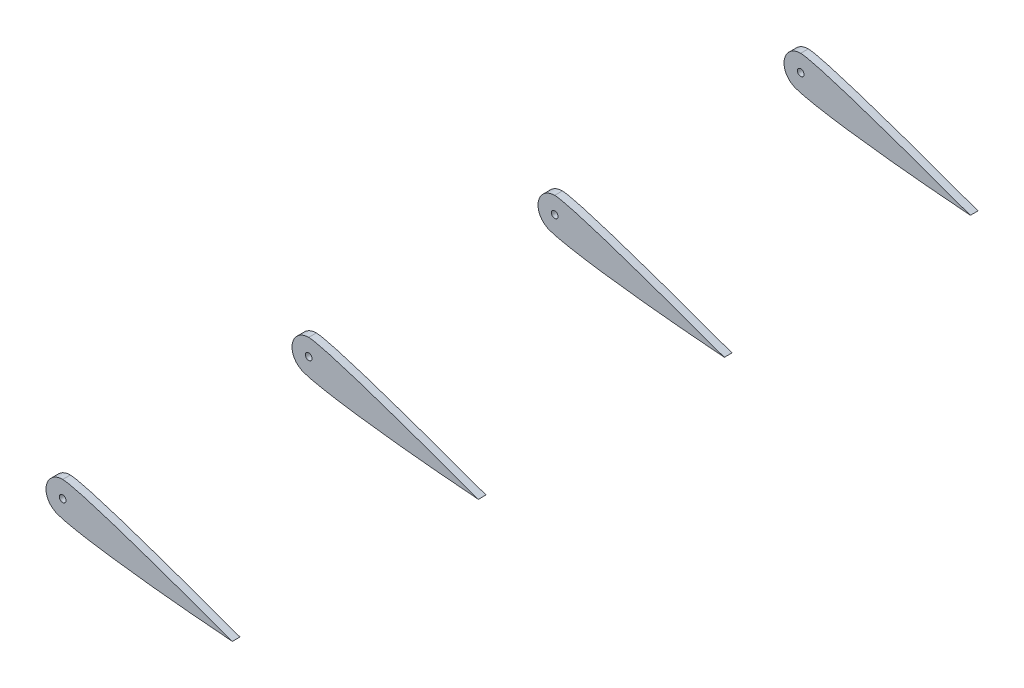
ISO-10303-21;
HEADER;
FILE_DESCRIPTION(('STEP AP214'),'2;1');
FILE_NAME('part.step','',(''),(''),'','','');
FILE_SCHEMA(('AUTOMOTIVE_DESIGN { 1 0 10303 214 1 1 1 1 }'));
ENDSEC;
DATA;
#1=APPLICATION_CONTEXT('core data for automotive mechanical design processes');
#2=APPLICATION_PROTOCOL_DEFINITION('international standard','automotive_design',2000,#1);
#3=PRODUCT_CONTEXT('',#1,'mechanical');
#4=PRODUCT('Part','Part','',(#3));
#5=PRODUCT_RELATED_PRODUCT_CATEGORY('part','',(#4));
#6=PRODUCT_DEFINITION_FORMATION('','',#4);
#7=PRODUCT_DEFINITION_CONTEXT('part definition',#1,'design');
#8=PRODUCT_DEFINITION('design','',#6,#7);
#9=PRODUCT_DEFINITION_SHAPE('','',#8);
#10=(LENGTH_UNIT() NAMED_UNIT(*) SI_UNIT(.MILLI.,.METRE.));
#11=(NAMED_UNIT(*) PLANE_ANGLE_UNIT() SI_UNIT($,.RADIAN.));
#12=(NAMED_UNIT(*) SI_UNIT($,.STERADIAN.) SOLID_ANGLE_UNIT());
#13=UNCERTAINTY_MEASURE_WITH_UNIT(LENGTH_MEASURE(1.E-05),#10,'distance_accuracy_value','');
#14=(GEOMETRIC_REPRESENTATION_CONTEXT(3) GLOBAL_UNCERTAINTY_ASSIGNED_CONTEXT((#13)) GLOBAL_UNIT_ASSIGNED_CONTEXT((#10,
#11,#12)) REPRESENTATION_CONTEXT('',''));
#15=CARTESIAN_POINT('',(0.,0.,0.));
#16=DIRECTION('',(0.,0.,1.));
#17=DIRECTION('',(1.,0.,0.));
#18=AXIS2_PLACEMENT_3D('',#15,#16,#17);
#19=CARTESIAN_POINT('',(15.6162319578332,0.772511857000253,223.266));
#20=DIRECTION('',(0.,0.,1.));
#21=DIRECTION('',(1.,0.,0.));
#22=AXIS2_PLACEMENT_3D('',#19,#20,#21);
#23=PLANE('',#22);
#24=CARTESIAN_POINT('',(50.8000000000001,-11.6107413862354,223.266));
#25=CARTESIAN_POINT('',(5.83246391566635,4.85039440711823,223.266));
#26=CARTESIAN_POINT('',(0.,5.,223.266));
#27=B_SPLINE_CURVE_WITH_KNOTS('',2,(#24,#25,#26),.UNSPECIFIED.,.F.,.F.,(3,3),(0.,1.),.UNSPECIFIED.);
#28=CARTESIAN_POINT('',(50.8000000000001,-11.6107413862354,223.266));
#29=VERTEX_POINT('',#28);
#30=CARTESIAN_POINT('',(0.,5.,223.266));
#31=VERTEX_POINT('',#30);
#32=EDGE_CURVE('E86',#29,#31,#27,.T.);
#33=ORIENTED_EDGE('',*,*,#32,.T.);
#34=CARTESIAN_POINT('',(0.,0.,223.266));
#35=DIRECTION('',(0.,0.,1.));
#36=DIRECTION('',(1.,0.,0.));
#37=AXIS2_PLACEMENT_3D('',#34,#35,#36);
#38=CIRCLE('',#37,5.);
#39=CARTESIAN_POINT('',(-2.42540850180828,-4.37234417668098,223.266));
#40=VERTEX_POINT('',#39);
#41=EDGE_CURVE('E82',#31,#40,#38,.T.);
#42=ORIENTED_EDGE('',*,*,#41,.T.);
#43=CARTESIAN_POINT('',(-2.42540850180828,-4.37234417668098,223.266));
#44=CARTESIAN_POINT('',(-0.753845449582207,-5.81112807303867,223.266));
#45=CARTESIAN_POINT('',(16.9221191637549,-8.96235950169323,223.266));
#46=CARTESIAN_POINT('',(50.8000000000001,-11.6107413862354,223.266));
#47=B_SPLINE_CURVE_WITH_KNOTS('',3,(#43,#44,#45,#46),.UNSPECIFIED.,.F.,.F.,(4,4),(0.,1.),.UNSPECIFIED.);
#48=EDGE_CURVE('E62',#40,#29,#47,.T.);
#49=ORIENTED_EDGE('',*,*,#48,.T.);
#50=EDGE_LOOP('',(#33,#42,#49));
#51=FACE_BOUND('',#50,.T.);
#52=CARTESIAN_POINT('',(0.,0.,223.266));
#53=DIRECTION('',(0.,0.,1.));
#54=DIRECTION('',(1.,0.,0.));
#55=AXIS2_PLACEMENT_3D('',#52,#53,#54);
#56=CIRCLE('',#55,0.999999999999998);
#57=CARTESIAN_POINT('',(0.999999999999998,0.,223.266));
#58=VERTEX_POINT('',#57);
#59=EDGE_CURVE('E95',#58,#58,#56,.T.);
#60=ORIENTED_EDGE('',*,*,#59,.F.);
#61=EDGE_LOOP('',(#60));
#62=FACE_BOUND('',#61,.T.);
#63=ADVANCED_FACE('F44',(#51,#62),#23,.T.);
#64=CARTESIAN_POINT('',(15.6162319578332,0.772511857000253,220.98));
#65=DIRECTION('',(0.,0.,1.));
#66=DIRECTION('',(1.,0.,0.));
#67=AXIS2_PLACEMENT_3D('',#64,#65,#66);
#68=PLANE('',#67);
#69=CARTESIAN_POINT('',(50.8000000000001,-11.6107413862354,220.98));
#70=CARTESIAN_POINT('',(5.83246391566635,4.85039440711823,220.98));
#71=CARTESIAN_POINT('',(0.,5.,220.98));
#72=B_SPLINE_CURVE_WITH_KNOTS('',2,(#69,#70,#71),.UNSPECIFIED.,.F.,.F.,(3,3),(0.,1.),.UNSPECIFIED.);
#73=CARTESIAN_POINT('',(50.8000000000001,-11.6107413862354,220.98));
#74=VERTEX_POINT('',#73);
#75=CARTESIAN_POINT('',(0.,5.,220.98));
#76=VERTEX_POINT('',#75);
#77=EDGE_CURVE('E92',#74,#76,#72,.T.);
#78=ORIENTED_EDGE('',*,*,#77,.F.);
#79=CARTESIAN_POINT('',(-2.42540850180828,-4.37234417668098,220.98));
#80=CARTESIAN_POINT('',(-0.753845449582207,-5.81112807303867,220.98));
#81=CARTESIAN_POINT('',(16.9221191637549,-8.96235950169323,220.98));
#82=CARTESIAN_POINT('',(50.8000000000001,-11.6107413862354,220.98));
#83=B_SPLINE_CURVE_WITH_KNOTS('',3,(#79,#80,#81,#82),.UNSPECIFIED.,.F.,.F.,(4,4),(0.,1.),.UNSPECIFIED.);
#84=CARTESIAN_POINT('',(-2.42540850180828,-4.37234417668098,220.98));
#85=VERTEX_POINT('',#84);
#86=EDGE_CURVE('E79',#85,#74,#83,.T.);
#87=ORIENTED_EDGE('',*,*,#86,.F.);
#88=CARTESIAN_POINT('',(0.,0.,220.98));
#89=DIRECTION('',(0.,0.,1.));
#90=DIRECTION('',(1.,0.,0.));
#91=AXIS2_PLACEMENT_3D('',#88,#89,#90);
#92=CIRCLE('',#91,5.);
#93=EDGE_CURVE('E74',#76,#85,#92,.T.);
#94=ORIENTED_EDGE('',*,*,#93,.F.);
#95=EDGE_LOOP('',(#78,#87,#94));
#96=FACE_BOUND('',#95,.T.);
#97=CARTESIAN_POINT('',(0.,0.,220.98));
#98=DIRECTION('',(0.,0.,1.));
#99=DIRECTION('',(1.,0.,0.));
#100=AXIS2_PLACEMENT_3D('',#97,#98,#99);
#101=CIRCLE('',#100,0.999999999999998);
#102=CARTESIAN_POINT('',(0.999999999999998,0.,220.98));
#103=VERTEX_POINT('',#102);
#104=EDGE_CURVE('E99',#103,#103,#101,.T.);
#105=ORIENTED_EDGE('',*,*,#104,.T.);
#106=EDGE_LOOP('',(#105));
#107=FACE_BOUND('',#106,.T.);
#108=ADVANCED_FACE('F118',(#96,#107),#68,.F.);
#109=DIRECTION('',(0.,0.,-1.));
#110=VECTOR('',#109,1.);
#111=SURFACE_OF_LINEAR_EXTRUSION('',#27,#110);
#112=ORIENTED_EDGE('',*,*,#77,.T.);
#113=DIRECTION('',(0.,0.,-1.));
#114=VECTOR('',#113,1.);
#115=CARTESIAN_POINT('',(0.,5.,223.266));
#116=LINE('',#115,#114);
#117=EDGE_CURVE('E12',#31,#76,#116,.T.);
#118=ORIENTED_EDGE('',*,*,#117,.F.);
#119=ORIENTED_EDGE('',*,*,#32,.F.);
#120=DIRECTION('',(0.,0.,-1.));
#121=VECTOR('',#120,1.);
#122=CARTESIAN_POINT('',(50.8000000000001,-11.6107413862354,223.266));
#123=LINE('',#122,#121);
#124=EDGE_CURVE('E93',#29,#74,#123,.T.);
#125=ORIENTED_EDGE('',*,*,#124,.T.);
#126=EDGE_LOOP('',(#112,#118,#119,#125));
#127=FACE_BOUND('',#126,.T.);
#128=ADVANCED_FACE('F46',(#127),#111,.F.);
#129=CARTESIAN_POINT('',(0.,0.,223.266));
#130=DIRECTION('',(0.,0.,-1.));
#131=DIRECTION('',(-1.,0.,0.));
#132=AXIS2_PLACEMENT_3D('',#129,#130,#131);
#133=CYLINDRICAL_SURFACE('',#132,5.);
#134=ORIENTED_EDGE('',*,*,#93,.T.);
#135=DIRECTION('',(0.,0.,-1.));
#136=VECTOR('',#135,1.);
#137=CARTESIAN_POINT('',(-2.42540850180828,-4.37234417668098,223.266));
#138=LINE('',#137,#136);
#139=EDGE_CURVE('E54',#40,#85,#138,.T.);
#140=ORIENTED_EDGE('',*,*,#139,.F.);
#141=ORIENTED_EDGE('',*,*,#41,.F.);
#142=ORIENTED_EDGE('',*,*,#117,.T.);
#143=EDGE_LOOP('',(#134,#140,#141,#142));
#144=FACE_BOUND('',#143,.T.);
#145=ADVANCED_FACE('F83',(#144),#133,.T.);
#146=DIRECTION('',(0.,0.,-1.));
#147=VECTOR('',#146,1.);
#148=SURFACE_OF_LINEAR_EXTRUSION('',#47,#147);
#149=ORIENTED_EDGE('',*,*,#86,.T.);
#150=ORIENTED_EDGE('',*,*,#124,.F.);
#151=ORIENTED_EDGE('',*,*,#48,.F.);
#152=ORIENTED_EDGE('',*,*,#139,.T.);
#153=EDGE_LOOP('',(#149,#150,#151,#152));
#154=FACE_BOUND('',#153,.T.);
#155=ADVANCED_FACE('F117',(#154),#148,.F.);
#156=CARTESIAN_POINT('',(0.,0.,223.266));
#157=DIRECTION('',(0.,0.,-1.));
#158=DIRECTION('',(-1.,0.,0.));
#159=AXIS2_PLACEMENT_3D('',#156,#157,#158);
#160=CYLINDRICAL_SURFACE('',#159,0.999999999999998);
#161=ORIENTED_EDGE('',*,*,#59,.T.);
#162=EDGE_LOOP('',(#161));
#163=FACE_BOUND('',#162,.T.);
#164=ORIENTED_EDGE('',*,*,#104,.F.);
#165=EDGE_LOOP('',(#164));
#166=FACE_BOUND('',#165,.T.);
#167=ADVANCED_FACE('F132',(#163,#166),#160,.F.);
#168=CLOSED_SHELL('',(#63,#108,#128,#145,#155,#167));
#169=MANIFOLD_SOLID_BREP('B2',#168);
#170=CARTESIAN_POINT('',(15.6162319578332,0.772511857000253,149.606));
#171=DIRECTION('',(0.,0.,1.));
#172=DIRECTION('',(1.,0.,0.));
#173=AXIS2_PLACEMENT_3D('',#170,#171,#172);
#174=PLANE('',#173);
#175=CARTESIAN_POINT('',(50.8000000000001,-11.6107413862354,149.606));
#176=CARTESIAN_POINT('',(5.83246391566635,4.85039440711823,149.606));
#177=CARTESIAN_POINT('',(0.,5.,149.606));
#178=B_SPLINE_CURVE_WITH_KNOTS('',2,(#175,#176,#177),.UNSPECIFIED.,.F.,.F.,(3,3),(0.,1.),.UNSPECIFIED.);
#179=CARTESIAN_POINT('',(50.8000000000001,-11.6107413862354,149.606));
#180=VERTEX_POINT('',#179);
#181=CARTESIAN_POINT('',(0.,5.,149.606));
#182=VERTEX_POINT('',#181);
#183=EDGE_CURVE('E237',#180,#182,#178,.T.);
#184=ORIENTED_EDGE('',*,*,#183,.T.);
#185=CARTESIAN_POINT('',(0.,0.,149.606));
#186=DIRECTION('',(0.,0.,1.));
#187=DIRECTION('',(1.,0.,0.));
#188=AXIS2_PLACEMENT_3D('',#185,#186,#187);
#189=CIRCLE('',#188,5.);
#190=CARTESIAN_POINT('',(-2.42540850180828,-4.37234417668098,149.606));
#191=VERTEX_POINT('',#190);
#192=EDGE_CURVE('E233',#182,#191,#189,.T.);
#193=ORIENTED_EDGE('',*,*,#192,.T.);
#194=CARTESIAN_POINT('',(-2.42540850180828,-4.37234417668098,149.606));
#195=CARTESIAN_POINT('',(-0.753845449582207,-5.81112807303867,149.606));
#196=CARTESIAN_POINT('',(16.9221191637549,-8.96235950169323,149.606));
#197=CARTESIAN_POINT('',(50.8000000000001,-11.6107413862354,149.606));
#198=B_SPLINE_CURVE_WITH_KNOTS('',3,(#194,#195,#196,#197),.UNSPECIFIED.,.F.,.F.,(4,4),(0.,1.),.UNSPECIFIED.);
#199=EDGE_CURVE('E213',#191,#180,#198,.T.);
#200=ORIENTED_EDGE('',*,*,#199,.T.);
#201=EDGE_LOOP('',(#184,#193,#200));
#202=FACE_BOUND('',#201,.T.);
#203=CARTESIAN_POINT('',(0.,0.,149.606));
#204=DIRECTION('',(0.,0.,1.));
#205=DIRECTION('',(1.,0.,0.));
#206=AXIS2_PLACEMENT_3D('',#203,#204,#205);
#207=CIRCLE('',#206,0.999999999999998);
#208=CARTESIAN_POINT('',(0.999999999999998,0.,149.606));
#209=VERTEX_POINT('',#208);
#210=EDGE_CURVE('E246',#209,#209,#207,.T.);
#211=ORIENTED_EDGE('',*,*,#210,.F.);
#212=EDGE_LOOP('',(#211));
#213=FACE_BOUND('',#212,.T.);
#214=ADVANCED_FACE('F195',(#202,#213),#174,.T.);
#215=CARTESIAN_POINT('',(15.6162319578332,0.772511857000253,147.32));
#216=DIRECTION('',(0.,0.,1.));
#217=DIRECTION('',(1.,0.,0.));
#218=AXIS2_PLACEMENT_3D('',#215,#216,#217);
#219=PLANE('',#218);
#220=CARTESIAN_POINT('',(50.8000000000001,-11.6107413862354,147.32));
#221=CARTESIAN_POINT('',(5.83246391566635,4.85039440711823,147.32));
#222=CARTESIAN_POINT('',(0.,5.,147.32));
#223=B_SPLINE_CURVE_WITH_KNOTS('',2,(#220,#221,#222),.UNSPECIFIED.,.F.,.F.,(3,3),(0.,1.),.UNSPECIFIED.);
#224=CARTESIAN_POINT('',(50.8000000000001,-11.6107413862354,147.32));
#225=VERTEX_POINT('',#224);
#226=CARTESIAN_POINT('',(0.,5.,147.32));
#227=VERTEX_POINT('',#226);
#228=EDGE_CURVE('E243',#225,#227,#223,.T.);
#229=ORIENTED_EDGE('',*,*,#228,.F.);
#230=CARTESIAN_POINT('',(-2.42540850180828,-4.37234417668098,147.32));
#231=CARTESIAN_POINT('',(-0.753845449582207,-5.81112807303867,147.32));
#232=CARTESIAN_POINT('',(16.9221191637549,-8.96235950169323,147.32));
#233=CARTESIAN_POINT('',(50.8000000000001,-11.6107413862354,147.32));
#234=B_SPLINE_CURVE_WITH_KNOTS('',3,(#230,#231,#232,#233),.UNSPECIFIED.,.F.,.F.,(4,4),(0.,1.),.UNSPECIFIED.);
#235=CARTESIAN_POINT('',(-2.42540850180828,-4.37234417668098,147.32));
#236=VERTEX_POINT('',#235);
#237=EDGE_CURVE('E230',#236,#225,#234,.T.);
#238=ORIENTED_EDGE('',*,*,#237,.F.);
#239=CARTESIAN_POINT('',(0.,0.,147.32));
#240=DIRECTION('',(0.,0.,1.));
#241=DIRECTION('',(1.,0.,0.));
#242=AXIS2_PLACEMENT_3D('',#239,#240,#241);
#243=CIRCLE('',#242,5.);
#244=EDGE_CURVE('E225',#227,#236,#243,.T.);
#245=ORIENTED_EDGE('',*,*,#244,.F.);
#246=EDGE_LOOP('',(#229,#238,#245));
#247=FACE_BOUND('',#246,.T.);
#248=CARTESIAN_POINT('',(0.,0.,147.32));
#249=DIRECTION('',(0.,0.,1.));
#250=DIRECTION('',(1.,0.,0.));
#251=AXIS2_PLACEMENT_3D('',#248,#249,#250);
#252=CIRCLE('',#251,0.999999999999998);
#253=CARTESIAN_POINT('',(0.999999999999998,0.,147.32));
#254=VERTEX_POINT('',#253);
#255=EDGE_CURVE('E250',#254,#254,#252,.T.);
#256=ORIENTED_EDGE('',*,*,#255,.T.);
#257=EDGE_LOOP('',(#256));
#258=FACE_BOUND('',#257,.T.);
#259=ADVANCED_FACE('F269',(#247,#258),#219,.F.);
#260=DIRECTION('',(0.,0.,-1.));
#261=VECTOR('',#260,1.);
#262=SURFACE_OF_LINEAR_EXTRUSION('',#178,#261);
#263=ORIENTED_EDGE('',*,*,#228,.T.);
#264=DIRECTION('',(0.,0.,-1.));
#265=VECTOR('',#264,1.);
#266=CARTESIAN_POINT('',(0.,5.,149.606));
#267=LINE('',#266,#265);
#268=EDGE_CURVE('E42',#182,#227,#267,.T.);
#269=ORIENTED_EDGE('',*,*,#268,.F.);
#270=ORIENTED_EDGE('',*,*,#183,.F.);
#271=DIRECTION('',(0.,0.,-1.));
#272=VECTOR('',#271,1.);
#273=CARTESIAN_POINT('',(50.8000000000001,-11.6107413862354,149.606));
#274=LINE('',#273,#272);
#275=EDGE_CURVE('E244',#180,#225,#274,.T.);
#276=ORIENTED_EDGE('',*,*,#275,.T.);
#277=EDGE_LOOP('',(#263,#269,#270,#276));
#278=FACE_BOUND('',#277,.T.);
#279=ADVANCED_FACE('F197',(#278),#262,.F.);
#280=CARTESIAN_POINT('',(0.,0.,149.606));
#281=DIRECTION('',(0.,0.,-1.));
#282=DIRECTION('',(-1.,0.,0.));
#283=AXIS2_PLACEMENT_3D('',#280,#281,#282);
#284=CYLINDRICAL_SURFACE('',#283,5.);
#285=ORIENTED_EDGE('',*,*,#244,.T.);
#286=DIRECTION('',(0.,0.,-1.));
#287=VECTOR('',#286,1.);
#288=CARTESIAN_POINT('',(-2.42540850180828,-4.37234417668098,149.606));
#289=LINE('',#288,#287);
#290=EDGE_CURVE('E205',#191,#236,#289,.T.);
#291=ORIENTED_EDGE('',*,*,#290,.F.);
#292=ORIENTED_EDGE('',*,*,#192,.F.);
#293=ORIENTED_EDGE('',*,*,#268,.T.);
#294=EDGE_LOOP('',(#285,#291,#292,#293));
#295=FACE_BOUND('',#294,.T.);
#296=ADVANCED_FACE('F234',(#295),#284,.T.);
#297=DIRECTION('',(0.,0.,-1.));
#298=VECTOR('',#297,1.);
#299=SURFACE_OF_LINEAR_EXTRUSION('',#198,#298);
#300=ORIENTED_EDGE('',*,*,#237,.T.);
#301=ORIENTED_EDGE('',*,*,#275,.F.);
#302=ORIENTED_EDGE('',*,*,#199,.F.);
#303=ORIENTED_EDGE('',*,*,#290,.T.);
#304=EDGE_LOOP('',(#300,#301,#302,#303));
#305=FACE_BOUND('',#304,.T.);
#306=ADVANCED_FACE('F268',(#305),#299,.F.);
#307=CARTESIAN_POINT('',(0.,0.,149.606));
#308=DIRECTION('',(0.,0.,-1.));
#309=DIRECTION('',(-1.,0.,0.));
#310=AXIS2_PLACEMENT_3D('',#307,#308,#309);
#311=CYLINDRICAL_SURFACE('',#310,0.999999999999998);
#312=ORIENTED_EDGE('',*,*,#210,.T.);
#313=EDGE_LOOP('',(#312));
#314=FACE_BOUND('',#313,.T.);
#315=ORIENTED_EDGE('',*,*,#255,.F.);
#316=EDGE_LOOP('',(#315));
#317=FACE_BOUND('',#316,.T.);
#318=ADVANCED_FACE('F283',(#314,#317),#311,.F.);
#319=CLOSED_SHELL('',(#214,#259,#279,#296,#306,#318));
#320=MANIFOLD_SOLID_BREP('B6',#319);
#321=CARTESIAN_POINT('',(15.6162319578332,0.772511857000253,75.946));
#322=DIRECTION('',(0.,0.,1.));
#323=DIRECTION('',(1.,0.,0.));
#324=AXIS2_PLACEMENT_3D('',#321,#322,#323);
#325=PLANE('',#324);
#326=CARTESIAN_POINT('',(50.8000000000001,-11.6107413862354,75.946));
#327=CARTESIAN_POINT('',(5.83246391566635,4.85039440711823,75.946));
#328=CARTESIAN_POINT('',(0.,5.,75.946));
#329=B_SPLINE_CURVE_WITH_KNOTS('',2,(#326,#327,#328),.UNSPECIFIED.,.F.,.F.,(3,3),(0.,1.),.UNSPECIFIED.);
#330=CARTESIAN_POINT('',(50.8000000000001,-11.6107413862354,75.946));
#331=VERTEX_POINT('',#330);
#332=CARTESIAN_POINT('',(0.,5.,75.946));
#333=VERTEX_POINT('',#332);
#334=EDGE_CURVE('E387',#331,#333,#329,.T.);
#335=ORIENTED_EDGE('',*,*,#334,.T.);
#336=CARTESIAN_POINT('',(0.,0.,75.946));
#337=DIRECTION('',(0.,0.,1.));
#338=DIRECTION('',(1.,0.,0.));
#339=AXIS2_PLACEMENT_3D('',#336,#337,#338);
#340=CIRCLE('',#339,5.);
#341=CARTESIAN_POINT('',(-2.42540850180828,-4.37234417668098,75.946));
#342=VERTEX_POINT('',#341);
#343=EDGE_CURVE('E383',#333,#342,#340,.T.);
#344=ORIENTED_EDGE('',*,*,#343,.T.);
#345=CARTESIAN_POINT('',(-2.42540850180828,-4.37234417668098,75.946));
#346=CARTESIAN_POINT('',(-0.753845449582207,-5.81112807303867,75.946));
#347=CARTESIAN_POINT('',(16.9221191637549,-8.96235950169323,75.946));
#348=CARTESIAN_POINT('',(50.8000000000001,-11.6107413862354,75.946));
#349=B_SPLINE_CURVE_WITH_KNOTS('',3,(#345,#346,#347,#348),.UNSPECIFIED.,.F.,.F.,(4,4),(0.,1.),.UNSPECIFIED.);
#350=EDGE_CURVE('E363',#342,#331,#349,.T.);
#351=ORIENTED_EDGE('',*,*,#350,.T.);
#352=EDGE_LOOP('',(#335,#344,#351));
#353=FACE_BOUND('',#352,.T.);
#354=CARTESIAN_POINT('',(0.,0.,75.946));
#355=DIRECTION('',(0.,0.,1.));
#356=DIRECTION('',(1.,0.,0.));
#357=AXIS2_PLACEMENT_3D('',#354,#355,#356);
#358=CIRCLE('',#357,0.999999999999998);
#359=CARTESIAN_POINT('',(0.999999999999998,0.,75.946));
#360=VERTEX_POINT('',#359);
#361=EDGE_CURVE('E396',#360,#360,#358,.T.);
#362=ORIENTED_EDGE('',*,*,#361,.F.);
#363=EDGE_LOOP('',(#362));
#364=FACE_BOUND('',#363,.T.);
#365=ADVANCED_FACE('F345',(#353,#364),#325,.T.);
#366=CARTESIAN_POINT('',(15.6162319578332,0.772511857000253,73.66));
#367=DIRECTION('',(0.,0.,1.));
#368=DIRECTION('',(1.,0.,0.));
#369=AXIS2_PLACEMENT_3D('',#366,#367,#368);
#370=PLANE('',#369);
#371=CARTESIAN_POINT('',(50.8000000000001,-11.6107413862354,73.66));
#372=CARTESIAN_POINT('',(5.83246391566635,4.85039440711823,73.66));
#373=CARTESIAN_POINT('',(0.,5.,73.66));
#374=B_SPLINE_CURVE_WITH_KNOTS('',2,(#371,#372,#373),.UNSPECIFIED.,.F.,.F.,(3,3),(0.,1.),.UNSPECIFIED.);
#375=CARTESIAN_POINT('',(50.8000000000001,-11.6107413862354,73.66));
#376=VERTEX_POINT('',#375);
#377=CARTESIAN_POINT('',(0.,5.,73.66));
#378=VERTEX_POINT('',#377);
#379=EDGE_CURVE('E393',#376,#378,#374,.T.);
#380=ORIENTED_EDGE('',*,*,#379,.F.);
#381=CARTESIAN_POINT('',(-2.42540850180828,-4.37234417668098,73.66));
#382=CARTESIAN_POINT('',(-0.753845449582207,-5.81112807303867,73.66));
#383=CARTESIAN_POINT('',(16.9221191637549,-8.96235950169323,73.66));
#384=CARTESIAN_POINT('',(50.8000000000001,-11.6107413862354,73.66));
#385=B_SPLINE_CURVE_WITH_KNOTS('',3,(#381,#382,#383,#384),.UNSPECIFIED.,.F.,.F.,(4,4),(0.,1.),.UNSPECIFIED.);
#386=CARTESIAN_POINT('',(-2.42540850180828,-4.37234417668098,73.66));
#387=VERTEX_POINT('',#386);
#388=EDGE_CURVE('E380',#387,#376,#385,.T.);
#389=ORIENTED_EDGE('',*,*,#388,.F.);
#390=CARTESIAN_POINT('',(0.,0.,73.66));
#391=DIRECTION('',(0.,0.,1.));
#392=DIRECTION('',(1.,0.,0.));
#393=AXIS2_PLACEMENT_3D('',#390,#391,#392);
#394=CIRCLE('',#393,5.);
#395=EDGE_CURVE('E375',#378,#387,#394,.T.);
#396=ORIENTED_EDGE('',*,*,#395,.F.);
#397=EDGE_LOOP('',(#380,#389,#396));
#398=FACE_BOUND('',#397,.T.);
#399=CARTESIAN_POINT('',(0.,0.,73.66));
#400=DIRECTION('',(0.,0.,1.));
#401=DIRECTION('',(1.,0.,0.));
#402=AXIS2_PLACEMENT_3D('',#399,#400,#401);
#403=CIRCLE('',#402,0.999999999999998);
#404=CARTESIAN_POINT('',(0.999999999999998,0.,73.66));
#405=VERTEX_POINT('',#404);
#406=EDGE_CURVE('E400',#405,#405,#403,.T.);
#407=ORIENTED_EDGE('',*,*,#406,.T.);
#408=EDGE_LOOP('',(#407));
#409=FACE_BOUND('',#408,.T.);
#410=ADVANCED_FACE('F419',(#398,#409),#370,.F.);
#411=DIRECTION('',(0.,0.,-1.));
#412=VECTOR('',#411,1.);
#413=SURFACE_OF_LINEAR_EXTRUSION('',#329,#412);
#414=ORIENTED_EDGE('',*,*,#379,.T.);
#415=DIRECTION('',(0.,0.,-1.));
#416=VECTOR('',#415,1.);
#417=CARTESIAN_POINT('',(0.,5.,75.946));
#418=LINE('',#417,#416);
#419=EDGE_CURVE('E193',#333,#378,#418,.T.);
#420=ORIENTED_EDGE('',*,*,#419,.F.);
#421=ORIENTED_EDGE('',*,*,#334,.F.);
#422=DIRECTION('',(0.,0.,-1.));
#423=VECTOR('',#422,1.);
#424=CARTESIAN_POINT('',(50.8000000000001,-11.6107413862354,75.946));
#425=LINE('',#424,#423);
#426=EDGE_CURVE('E394',#331,#376,#425,.T.);
#427=ORIENTED_EDGE('',*,*,#426,.T.);
#428=EDGE_LOOP('',(#414,#420,#421,#427));
#429=FACE_BOUND('',#428,.T.);
#430=ADVANCED_FACE('F347',(#429),#413,.F.);
#431=CARTESIAN_POINT('',(0.,0.,75.946));
#432=DIRECTION('',(0.,0.,-1.));
#433=DIRECTION('',(-1.,0.,0.));
#434=AXIS2_PLACEMENT_3D('',#431,#432,#433);
#435=CYLINDRICAL_SURFACE('',#434,5.);
#436=ORIENTED_EDGE('',*,*,#395,.T.);
#437=DIRECTION('',(0.,0.,-1.));
#438=VECTOR('',#437,1.);
#439=CARTESIAN_POINT('',(-2.42540850180828,-4.37234417668098,75.946));
#440=LINE('',#439,#438);
#441=EDGE_CURVE('E355',#342,#387,#440,.T.);
#442=ORIENTED_EDGE('',*,*,#441,.F.);
#443=ORIENTED_EDGE('',*,*,#343,.F.);
#444=ORIENTED_EDGE('',*,*,#419,.T.);
#445=EDGE_LOOP('',(#436,#442,#443,#444));
#446=FACE_BOUND('',#445,.T.);
#447=ADVANCED_FACE('F384',(#446),#435,.T.);
#448=DIRECTION('',(0.,0.,-1.));
#449=VECTOR('',#448,1.);
#450=SURFACE_OF_LINEAR_EXTRUSION('',#349,#449);
#451=ORIENTED_EDGE('',*,*,#388,.T.);
#452=ORIENTED_EDGE('',*,*,#426,.F.);
#453=ORIENTED_EDGE('',*,*,#350,.F.);
#454=ORIENTED_EDGE('',*,*,#441,.T.);
#455=EDGE_LOOP('',(#451,#452,#453,#454));
#456=FACE_BOUND('',#455,.T.);
#457=ADVANCED_FACE('F418',(#456),#450,.F.);
#458=CARTESIAN_POINT('',(0.,0.,75.946));
#459=DIRECTION('',(0.,0.,-1.));
#460=DIRECTION('',(-1.,0.,0.));
#461=AXIS2_PLACEMENT_3D('',#458,#459,#460);
#462=CYLINDRICAL_SURFACE('',#461,0.999999999999998);
#463=ORIENTED_EDGE('',*,*,#361,.T.);
#464=EDGE_LOOP('',(#463));
#465=FACE_BOUND('',#464,.T.);
#466=ORIENTED_EDGE('',*,*,#406,.F.);
#467=EDGE_LOOP('',(#466));
#468=FACE_BOUND('',#467,.T.);
#469=ADVANCED_FACE('F433',(#465,#468),#462,.F.);
#470=CLOSED_SHELL('',(#365,#410,#430,#447,#457,#469));
#471=MANIFOLD_SOLID_BREP('B36',#470);
#472=CARTESIAN_POINT('',(15.6162319578332,0.772511857000253,2.286));
#473=DIRECTION('',(0.,0.,1.));
#474=DIRECTION('',(1.,0.,0.));
#475=AXIS2_PLACEMENT_3D('',#472,#473,#474);
#476=PLANE('',#475);
#477=CARTESIAN_POINT('',(50.8000000000001,-11.6107413862354,2.286));
#478=CARTESIAN_POINT('',(5.83246391566635,4.85039440711823,2.286));
#479=CARTESIAN_POINT('',(0.,5.,2.286));
#480=B_SPLINE_CURVE_WITH_KNOTS('',2,(#477,#478,#479),.UNSPECIFIED.,.F.,.F.,(3,3),(0.,1.),.UNSPECIFIED.);
#481=CARTESIAN_POINT('',(50.8000000000001,-11.6107413862354,2.286));
#482=VERTEX_POINT('',#481);
#483=CARTESIAN_POINT('',(0.,5.,2.286));
#484=VERTEX_POINT('',#483);
#485=EDGE_CURVE('E528',#482,#484,#480,.T.);
#486=ORIENTED_EDGE('',*,*,#485,.T.);
#487=CARTESIAN_POINT('',(0.,0.,2.286));
#488=DIRECTION('',(0.,0.,1.));
#489=DIRECTION('',(1.,0.,0.));
#490=AXIS2_PLACEMENT_3D('',#487,#488,#489);
#491=CIRCLE('',#490,5.);
#492=CARTESIAN_POINT('',(-2.42540850180828,-4.37234417668098,2.286));
#493=VERTEX_POINT('',#492);
#494=EDGE_CURVE('E524',#484,#493,#491,.T.);
#495=ORIENTED_EDGE('',*,*,#494,.T.);
#496=CARTESIAN_POINT('',(-2.42540850180828,-4.37234417668098,2.286));
#497=CARTESIAN_POINT('',(-0.753845449582207,-5.81112807303867,2.286));
#498=CARTESIAN_POINT('',(16.9221191637549,-8.96235950169323,2.286));
#499=CARTESIAN_POINT('',(50.8000000000001,-11.6107413862354,2.286));
#500=B_SPLINE_CURVE_WITH_KNOTS('',3,(#496,#497,#498,#499),.UNSPECIFIED.,.F.,.F.,(4,4),(0.,1.),.UNSPECIFIED.);
#501=EDGE_CURVE('E504',#493,#482,#500,.T.);
#502=ORIENTED_EDGE('',*,*,#501,.T.);
#503=EDGE_LOOP('',(#486,#495,#502));
#504=FACE_BOUND('',#503,.T.);
#505=CARTESIAN_POINT('',(0.,0.,2.286));
#506=DIRECTION('',(0.,0.,1.));
#507=DIRECTION('',(1.,0.,0.));
#508=AXIS2_PLACEMENT_3D('',#505,#506,#507);
#509=CIRCLE('',#508,0.999999999999998);
#510=CARTESIAN_POINT('',(0.999999999999998,0.,2.286));
#511=VERTEX_POINT('',#510);
#512=EDGE_CURVE('E537',#511,#511,#509,.T.);
#513=ORIENTED_EDGE('',*,*,#512,.F.);
#514=EDGE_LOOP('',(#513));
#515=FACE_BOUND('',#514,.T.);
#516=ADVANCED_FACE('F486',(#504,#515),#476,.T.);
#517=CARTESIAN_POINT('',(15.6162319578332,0.772511857000253,0.));
#518=DIRECTION('',(0.,0.,1.));
#519=DIRECTION('',(1.,0.,0.));
#520=AXIS2_PLACEMENT_3D('',#517,#518,#519);
#521=PLANE('',#520);
#522=CARTESIAN_POINT('',(50.8000000000001,-11.6107413862354,0.));
#523=CARTESIAN_POINT('',(5.83246391566635,4.85039440711823,0.));
#524=CARTESIAN_POINT('',(0.,5.,0.));
#525=B_SPLINE_CURVE_WITH_KNOTS('',2,(#522,#523,#524),.UNSPECIFIED.,.F.,.F.,(3,3),(0.,1.),.UNSPECIFIED.);
#526=CARTESIAN_POINT('',(50.8000000000001,-11.6107413862354,0.));
#527=VERTEX_POINT('',#526);
#528=CARTESIAN_POINT('',(0.,5.,0.));
#529=VERTEX_POINT('',#528);
#530=EDGE_CURVE('E534',#527,#529,#525,.T.);
#531=ORIENTED_EDGE('',*,*,#530,.F.);
#532=CARTESIAN_POINT('',(-2.42540850180828,-4.37234417668098,0.));
#533=CARTESIAN_POINT('',(-0.753845449582207,-5.81112807303867,0.));
#534=CARTESIAN_POINT('',(16.9221191637549,-8.96235950169323,0.));
#535=CARTESIAN_POINT('',(50.8000000000001,-11.6107413862354,0.));
#536=B_SPLINE_CURVE_WITH_KNOTS('',3,(#532,#533,#534,#535),.UNSPECIFIED.,.F.,.F.,(4,4),(0.,1.),.UNSPECIFIED.);
#537=CARTESIAN_POINT('',(-2.42540850180828,-4.37234417668098,0.));
#538=VERTEX_POINT('',#537);
#539=EDGE_CURVE('E521',#538,#527,#536,.T.);
#540=ORIENTED_EDGE('',*,*,#539,.F.);
#541=CARTESIAN_POINT('',(0.,0.,0.));
#542=DIRECTION('',(0.,0.,1.));
#543=DIRECTION('',(1.,0.,0.));
#544=AXIS2_PLACEMENT_3D('',#541,#542,#543);
#545=CIRCLE('',#544,5.);
#546=EDGE_CURVE('E516',#529,#538,#545,.T.);
#547=ORIENTED_EDGE('',*,*,#546,.F.);
#548=EDGE_LOOP('',(#531,#540,#547));
#549=FACE_BOUND('',#548,.T.);
#550=CARTESIAN_POINT('',(0.,0.,0.));
#551=DIRECTION('',(0.,0.,1.));
#552=DIRECTION('',(1.,0.,0.));
#553=AXIS2_PLACEMENT_3D('',#550,#551,#552);
#554=CIRCLE('',#553,0.999999999999998);
#555=CARTESIAN_POINT('',(0.999999999999998,0.,0.));
#556=VERTEX_POINT('',#555);
#557=EDGE_CURVE('E541',#556,#556,#554,.T.);
#558=ORIENTED_EDGE('',*,*,#557,.T.);
#559=EDGE_LOOP('',(#558));
#560=FACE_BOUND('',#559,.T.);
#561=ADVANCED_FACE('F560',(#549,#560),#521,.F.);
#562=DIRECTION('',(0.,0.,-1.));
#563=VECTOR('',#562,1.);
#564=SURFACE_OF_LINEAR_EXTRUSION('',#480,#563);
#565=ORIENTED_EDGE('',*,*,#530,.T.);
#566=DIRECTION('',(0.,0.,-1.));
#567=VECTOR('',#566,1.);
#568=CARTESIAN_POINT('',(0.,5.,2.286));
#569=LINE('',#568,#567);
#570=EDGE_CURVE('E343',#484,#529,#569,.T.);
#571=ORIENTED_EDGE('',*,*,#570,.F.);
#572=ORIENTED_EDGE('',*,*,#485,.F.);
#573=DIRECTION('',(0.,0.,-1.));
#574=VECTOR('',#573,1.);
#575=CARTESIAN_POINT('',(50.8000000000001,-11.6107413862354,2.286));
#576=LINE('',#575,#574);
#577=EDGE_CURVE('E535',#482,#527,#576,.T.);
#578=ORIENTED_EDGE('',*,*,#577,.T.);
#579=EDGE_LOOP('',(#565,#571,#572,#578));
#580=FACE_BOUND('',#579,.T.);
#581=ADVANCED_FACE('F488',(#580),#564,.F.);
#582=CARTESIAN_POINT('',(0.,0.,2.286));
#583=DIRECTION('',(0.,0.,-1.));
#584=DIRECTION('',(-1.,0.,0.));
#585=AXIS2_PLACEMENT_3D('',#582,#583,#584);
#586=CYLINDRICAL_SURFACE('',#585,5.);
#587=ORIENTED_EDGE('',*,*,#546,.T.);
#588=DIRECTION('',(0.,0.,-1.));
#589=VECTOR('',#588,1.);
#590=CARTESIAN_POINT('',(-2.42540850180828,-4.37234417668098,2.286));
#591=LINE('',#590,#589);
#592=EDGE_CURVE('E496',#493,#538,#591,.T.);
#593=ORIENTED_EDGE('',*,*,#592,.F.);
#594=ORIENTED_EDGE('',*,*,#494,.F.);
#595=ORIENTED_EDGE('',*,*,#570,.T.);
#596=EDGE_LOOP('',(#587,#593,#594,#595));
#597=FACE_BOUND('',#596,.T.);
#598=ADVANCED_FACE('F525',(#597),#586,.T.);
#599=DIRECTION('',(0.,0.,-1.));
#600=VECTOR('',#599,1.);
#601=SURFACE_OF_LINEAR_EXTRUSION('',#500,#600);
#602=ORIENTED_EDGE('',*,*,#539,.T.);
#603=ORIENTED_EDGE('',*,*,#577,.F.);
#604=ORIENTED_EDGE('',*,*,#501,.F.);
#605=ORIENTED_EDGE('',*,*,#592,.T.);
#606=EDGE_LOOP('',(#602,#603,#604,#605));
#607=FACE_BOUND('',#606,.T.);
#608=ADVANCED_FACE('F559',(#607),#601,.F.);
#609=CARTESIAN_POINT('',(0.,0.,2.286));
#610=DIRECTION('',(0.,0.,-1.));
#611=DIRECTION('',(-1.,0.,0.));
#612=AXIS2_PLACEMENT_3D('',#609,#610,#611);
#613=CYLINDRICAL_SURFACE('',#612,0.999999999999998);
#614=ORIENTED_EDGE('',*,*,#512,.T.);
#615=EDGE_LOOP('',(#614));
#616=FACE_BOUND('',#615,.T.);
#617=ORIENTED_EDGE('',*,*,#557,.F.);
#618=EDGE_LOOP('',(#617));
#619=FACE_BOUND('',#618,.T.);
#620=ADVANCED_FACE('F574',(#616,#619),#613,.F.);
#621=CLOSED_SHELL('',(#516,#561,#581,#598,#608,#620));
#622=MANIFOLD_SOLID_BREP('B187',#621);
#623=ADVANCED_BREP_SHAPE_REPRESENTATION('',(#18,#169,#320,#471,#622),#14);
#624=SHAPE_DEFINITION_REPRESENTATION(#9,#623);
ENDSEC;
END-ISO-10303-21;
